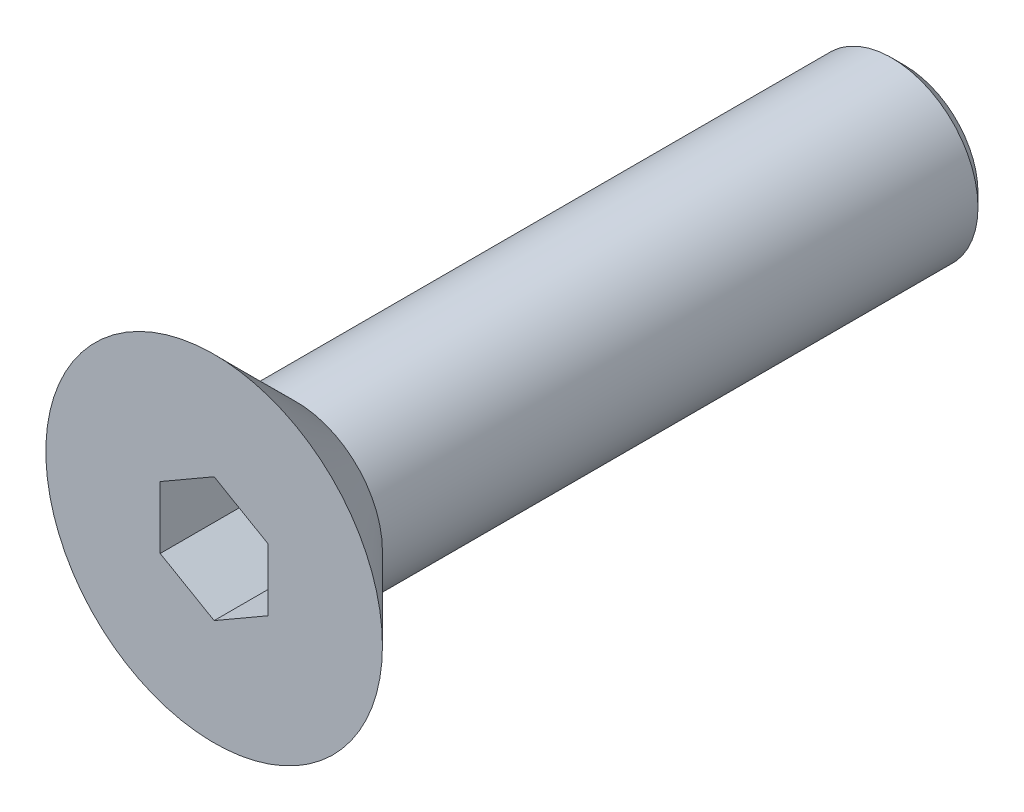
ISO-10303-21;
HEADER;
FILE_DESCRIPTION(('STEP AP214'),'2;1');
FILE_NAME('part.step','',(''),(''),'','','');
FILE_SCHEMA(('AUTOMOTIVE_DESIGN { 1 0 10303 214 1 1 1 1 }'));
ENDSEC;
DATA;
#1=APPLICATION_CONTEXT('core data for automotive mechanical design processes');
#2=APPLICATION_PROTOCOL_DEFINITION('international standard','automotive_design',2000,#1);
#3=PRODUCT_CONTEXT('',#1,'mechanical');
#4=PRODUCT('Part','Part','',(#3));
#5=PRODUCT_RELATED_PRODUCT_CATEGORY('part','',(#4));
#6=PRODUCT_DEFINITION_FORMATION('','',#4);
#7=PRODUCT_DEFINITION_CONTEXT('part definition',#1,'design');
#8=PRODUCT_DEFINITION('design','',#6,#7);
#9=PRODUCT_DEFINITION_SHAPE('','',#8);
#10=(LENGTH_UNIT() NAMED_UNIT(*) SI_UNIT(.MILLI.,.METRE.));
#11=(NAMED_UNIT(*) PLANE_ANGLE_UNIT() SI_UNIT($,.RADIAN.));
#12=(NAMED_UNIT(*) SI_UNIT($,.STERADIAN.) SOLID_ANGLE_UNIT());
#13=UNCERTAINTY_MEASURE_WITH_UNIT(LENGTH_MEASURE(1.E-05),#10,'distance_accuracy_value','');
#14=(GEOMETRIC_REPRESENTATION_CONTEXT(3) GLOBAL_UNCERTAINTY_ASSIGNED_CONTEXT((#13)) GLOBAL_UNIT_ASSIGNED_CONTEXT((#10,
#11,#12)) REPRESENTATION_CONTEXT('',''));
#15=CARTESIAN_POINT('',(0.,0.,0.));
#16=DIRECTION('',(0.,0.,1.));
#17=DIRECTION('',(1.,0.,0.));
#18=AXIS2_PLACEMENT_3D('',#15,#16,#17);
#19=CARTESIAN_POINT('',(0.,0.,2.3));
#20=DIRECTION('',(0.,0.,1.));
#21=DIRECTION('',(1.,0.,0.));
#22=AXIS2_PLACEMENT_3D('',#19,#20,#21);
#23=PLANE('',#22);
#24=CARTESIAN_POINT('',(0.,0.,2.3));
#25=DIRECTION('',(0.,0.,1.));
#26=DIRECTION('',(1.,0.,0.));
#27=AXIS2_PLACEMENT_3D('',#24,#25,#26);
#28=CIRCLE('',#27,3.89999999999996);
#29=CARTESIAN_POINT('',(3.89999999999996,0.,2.3));
#30=VERTEX_POINT('',#29);
#31=EDGE_CURVE('E41',#30,#30,#28,.T.);
#32=ORIENTED_EDGE('',*,*,#31,.T.);
#33=EDGE_LOOP('',(#32));
#34=FACE_BOUND('',#33,.T.);
#35=DIRECTION('',(-0.866025403784439,0.5,0.));
#36=VECTOR('',#35,1.);
#37=CARTESIAN_POINT('',(1.25,0.721687836487033,2.3));
#38=LINE('',#37,#36);
#39=CARTESIAN_POINT('',(1.25,0.721687836487033,2.3));
#40=VERTEX_POINT('',#39);
#41=CARTESIAN_POINT('',(0.,1.44337567297406,2.3));
#42=VERTEX_POINT('',#41);
#43=EDGE_CURVE('E48',#40,#42,#38,.T.);
#44=ORIENTED_EDGE('',*,*,#43,.F.);
#45=DIRECTION('',(0.,1.,0.));
#46=VECTOR('',#45,1.);
#47=CARTESIAN_POINT('',(1.25,-0.721687836487033,2.3));
#48=LINE('',#47,#46);
#49=CARTESIAN_POINT('',(1.25,-0.721687836487033,2.3));
#50=VERTEX_POINT('',#49);
#51=EDGE_CURVE('E131',#50,#40,#48,.T.);
#52=ORIENTED_EDGE('',*,*,#51,.F.);
#53=DIRECTION('',(0.866025403784439,0.5,0.));
#54=VECTOR('',#53,1.);
#55=CARTESIAN_POINT('',(0.,-1.44337567297406,2.3));
#56=LINE('',#55,#54);
#57=CARTESIAN_POINT('',(0.,-1.44337567297406,2.3));
#58=VERTEX_POINT('',#57);
#59=EDGE_CURVE('E129',#58,#50,#56,.T.);
#60=ORIENTED_EDGE('',*,*,#59,.F.);
#61=DIRECTION('',(0.866025403784439,-0.5,0.));
#62=VECTOR('',#61,1.);
#63=CARTESIAN_POINT('',(-1.25,-0.721687836487032,2.3));
#64=LINE('',#63,#62);
#65=CARTESIAN_POINT('',(-1.25,-0.721687836487032,2.3));
#66=VERTEX_POINT('',#65);
#67=EDGE_CURVE('E96',#66,#58,#64,.T.);
#68=ORIENTED_EDGE('',*,*,#67,.F.);
#69=DIRECTION('',(0.,-1.,0.));
#70=VECTOR('',#69,1.);
#71=CARTESIAN_POINT('',(-1.25,0.721687836487033,2.3));
#72=LINE('',#71,#70);
#73=CARTESIAN_POINT('',(-1.25,0.721687836487033,2.3));
#74=VERTEX_POINT('',#73);
#75=EDGE_CURVE('E125',#74,#66,#72,.T.);
#76=ORIENTED_EDGE('',*,*,#75,.F.);
#77=DIRECTION('',(-0.866025403784439,-0.5,0.));
#78=VECTOR('',#77,1.);
#79=CARTESIAN_POINT('',(0.,1.44337567297406,2.3));
#80=LINE('',#79,#78);
#81=EDGE_CURVE('E122',#42,#74,#80,.T.);
#82=ORIENTED_EDGE('',*,*,#81,.F.);
#83=EDGE_LOOP('',(#44,#52,#60,#68,#76,#82));
#84=FACE_BOUND('',#83,.T.);
#85=ADVANCED_FACE('F33',(#34,#84),#23,.T.);
#86=CARTESIAN_POINT('',(0.,0.,-13.7));
#87=DIRECTION('',(0.,0.,1.));
#88=DIRECTION('',(1.,0.,0.));
#89=AXIS2_PLACEMENT_3D('',#86,#87,#88);
#90=CYLINDRICAL_SURFACE('',#89,2.);
#91=CARTESIAN_POINT('',(0.,0.,0.400000000000021));
#92=DIRECTION('',(0.,0.,1.));
#93=DIRECTION('',(1.,0.,0.));
#94=AXIS2_PLACEMENT_3D('',#91,#92,#93);
#95=CIRCLE('',#94,2.);
#96=CARTESIAN_POINT('',(2.,0.,0.400000000000022));
#97=VERTEX_POINT('',#96);
#98=EDGE_CURVE('E11',#97,#97,#95,.F.);
#99=CARTESIAN_POINT('',(0.,0.,-13.4));
#100=DIRECTION('',(0.,0.,-1.));
#101=DIRECTION('',(-1.,0.,0.));
#102=AXIS2_PLACEMENT_3D('',#99,#100,#101);
#103=CIRCLE('',#102,2.);
#104=CARTESIAN_POINT('',(2.,0.,-13.4));
#105=VERTEX_POINT('',#104);
#106=EDGE_CURVE('E143',#105,#105,#103,.F.);
#107=CARTESIAN_POINT('',(2.,0.,0.400000000000022));
#108=CARTESIAN_POINT('',(2.,0.,0.256250000000022));
#109=CARTESIAN_POINT('',(2.,0.,0.112500000000021));
#110=CARTESIAN_POINT('',(2.,0.,-0.17499999999998));
#111=CARTESIAN_POINT('',(2.,0.,-0.31874999999998));
#112=CARTESIAN_POINT('',(2.,0.,-0.606249999999981));
#113=CARTESIAN_POINT('',(2.,0.,-0.749999999999981));
#114=CARTESIAN_POINT('',(2.,0.,-1.03749999999998));
#115=CARTESIAN_POINT('',(2.,0.,-1.18124999999998));
#116=CARTESIAN_POINT('',(2.,0.,-1.46874999999998));
#117=CARTESIAN_POINT('',(2.,0.,-1.61249999999998));
#118=CARTESIAN_POINT('',(2.,0.,-1.89999999999998));
#119=CARTESIAN_POINT('',(2.,0.,-2.04374999999998));
#120=CARTESIAN_POINT('',(2.,0.,-2.33124999999998));
#121=CARTESIAN_POINT('',(2.,0.,-2.47499999999999));
#122=CARTESIAN_POINT('',(2.,0.,-2.76249999999999));
#123=CARTESIAN_POINT('',(2.,0.,-2.90624999999999));
#124=CARTESIAN_POINT('',(2.,0.,-3.19374999999999));
#125=CARTESIAN_POINT('',(2.,0.,-3.33749999999999));
#126=CARTESIAN_POINT('',(2.,0.,-3.62499999999999));
#127=CARTESIAN_POINT('',(2.,0.,-3.76874999999999));
#128=CARTESIAN_POINT('',(2.,0.,-4.05624999999999));
#129=CARTESIAN_POINT('',(2.,0.,-4.19999999999999));
#130=CARTESIAN_POINT('',(2.,0.,-4.48749999999999));
#131=CARTESIAN_POINT('',(2.,0.,-4.63124999999999));
#132=CARTESIAN_POINT('',(2.,0.,-4.91874999999999));
#133=CARTESIAN_POINT('',(2.,0.,-5.06249999999999));
#134=CARTESIAN_POINT('',(2.,0.,-5.34999999999999));
#135=CARTESIAN_POINT('',(2.,0.,-5.49374999999999));
#136=CARTESIAN_POINT('',(2.,0.,-5.78124999999999));
#137=CARTESIAN_POINT('',(2.,0.,-5.92499999999999));
#138=CARTESIAN_POINT('',(2.,0.,-6.21249999999999));
#139=CARTESIAN_POINT('',(2.,0.,-6.35624999999999));
#140=CARTESIAN_POINT('',(2.,0.,-6.64374999999999));
#141=CARTESIAN_POINT('',(2.,0.,-6.78749999999999));
#142=CARTESIAN_POINT('',(2.,0.,-7.07499999999999));
#143=CARTESIAN_POINT('',(2.,0.,-7.21874999999999));
#144=CARTESIAN_POINT('',(2.,0.,-7.50625));
#145=CARTESIAN_POINT('',(2.,0.,-7.65));
#146=CARTESIAN_POINT('',(2.,0.,-7.9375));
#147=CARTESIAN_POINT('',(2.,0.,-8.08125));
#148=CARTESIAN_POINT('',(2.,0.,-8.36875));
#149=CARTESIAN_POINT('',(2.,0.,-8.5125));
#150=CARTESIAN_POINT('',(2.,0.,-8.8));
#151=CARTESIAN_POINT('',(2.,0.,-8.94375));
#152=CARTESIAN_POINT('',(2.,0.,-9.23125));
#153=CARTESIAN_POINT('',(2.,0.,-9.375));
#154=CARTESIAN_POINT('',(2.,0.,-9.6625));
#155=CARTESIAN_POINT('',(2.,0.,-9.80625));
#156=CARTESIAN_POINT('',(2.,0.,-10.09375));
#157=CARTESIAN_POINT('',(2.,0.,-10.2375));
#158=CARTESIAN_POINT('',(2.,0.,-10.525));
#159=CARTESIAN_POINT('',(2.,0.,-10.66875));
#160=CARTESIAN_POINT('',(2.,0.,-10.95625));
#161=CARTESIAN_POINT('',(2.,0.,-11.1));
#162=CARTESIAN_POINT('',(2.,0.,-11.3875));
#163=CARTESIAN_POINT('',(2.,0.,-11.53125));
#164=CARTESIAN_POINT('',(2.,0.,-11.81875));
#165=CARTESIAN_POINT('',(2.,0.,-11.9625));
#166=CARTESIAN_POINT('',(2.,0.,-12.25));
#167=CARTESIAN_POINT('',(2.,0.,-12.39375));
#168=CARTESIAN_POINT('',(2.,0.,-12.68125));
#169=CARTESIAN_POINT('',(2.,0.,-12.825));
#170=CARTESIAN_POINT('',(2.,0.,-13.1125));
#171=CARTESIAN_POINT('',(2.,0.,-13.25625));
#172=CARTESIAN_POINT('',(2.,0.,-13.4));
#173=B_SPLINE_CURVE_WITH_KNOTS('',3,(#107,#108,#109,#110,#111,#112,#113,#114,#115,#116,#117,
#118,#119,#120,#121,#122,#123,#124,#125,#126,#127,#128,#129,#130,#131,#132,#133,#134,#135,#136,
#137,#138,#139,#140,#141,#142,#143,#144,#145,#146,#147,#148,#149,#150,#151,#152,#153,#154,#155,
#156,#157,#158,#159,#160,#161,#162,#163,#164,#165,#166,#167,#168,#169,#170,#171,#172),
.UNSPECIFIED.,.F.,.F.,(4,2,2,2,2,2,2,2,2,2,2,2,2,2,2,2,2,2,2,2,2,2,2,2,2,2,2,2,2,2,2,2,4),(0.,
0.431250000000001,0.862500000000002,1.29375,1.725,2.15625000000001,2.58750000000001,
3.01875000000001,3.45000000000001,3.88125000000001,4.31250000000001,4.74375000000001,
5.17500000000001,5.60625000000001,6.03750000000001,6.46875000000001,6.90000000000001,
7.33125000000002,7.76250000000002,8.19375000000002,8.62500000000002,9.05625000000002,
9.48750000000002,9.91875000000002,10.35,10.78125,11.2125,11.64375,12.075,12.50625,12.9375,
13.36875,13.8),.UNSPECIFIED.);
#174=EDGE_CURVE('BSEAM159',#97,#105,#173,.T.);
#175=ORIENTED_EDGE('',*,*,#98,.T.);
#176=ORIENTED_EDGE('',*,*,#106,.T.);
#177=ORIENTED_EDGE('',*,*,#174,.T.);
#178=ORIENTED_EDGE('',*,*,#174,.F.);
#179=EDGE_LOOP('',(#175,#177,#176,#178));
#180=FACE_BOUND('',#179,.T.);
#181=ADVANCED_FACE('F159',(#180),#90,.T.);
#182=CARTESIAN_POINT('',(0.,0.,-13.7));
#183=DIRECTION('',(0.,0.,-1.));
#184=DIRECTION('',(-1.,0.,0.));
#185=AXIS2_PLACEMENT_3D('',#182,#183,#184);
#186=PLANE('',#185);
#187=CARTESIAN_POINT('',(0.,0.,-13.7));
#188=DIRECTION('',(0.,0.,-1.));
#189=DIRECTION('',(-1.,0.,0.));
#190=AXIS2_PLACEMENT_3D('',#187,#188,#189);
#191=CIRCLE('',#190,1.70000000000001);
#192=CARTESIAN_POINT('',(-1.70000000000001,0.,-13.7));
#193=VERTEX_POINT('',#192);
#194=EDGE_CURVE('E135',#193,#193,#191,.T.);
#195=ORIENTED_EDGE('',*,*,#194,.T.);
#196=EDGE_LOOP('',(#195));
#197=FACE_BOUND('',#196,.T.);
#198=ADVANCED_FACE('F164',(#197),#186,.T.);
#199=CARTESIAN_POINT('',(0.,0.,-13.7));
#200=DIRECTION('',(0.,0.,1.));
#201=DIRECTION('',(1.,0.,0.));
#202=AXIS2_PLACEMENT_3D('',#199,#200,#201);
#203=CONICAL_SURFACE('',#202,1.70000000000001,0.785398163397446);
#204=ORIENTED_EDGE('',*,*,#106,.F.);
#205=EDGE_LOOP('',(#204));
#206=FACE_BOUND('',#205,.T.);
#207=ORIENTED_EDGE('',*,*,#194,.F.);
#208=EDGE_LOOP('',(#207));
#209=FACE_BOUND('',#208,.T.);
#210=ADVANCED_FACE('F168',(#206,#209),#203,.T.);
#211=CARTESIAN_POINT('',(1.25,0.721687836487033,0.3));
#212=DIRECTION('',(0.5,0.866025403784439,0.));
#213=DIRECTION('',(-0.866025403784439,0.5,0.));
#214=AXIS2_PLACEMENT_3D('',#211,#212,#213);
#215=PLANE('',#214);
#216=ORIENTED_EDGE('',*,*,#43,.T.);
#217=DIRECTION('',(0.,0.,1.));
#218=VECTOR('',#217,1.);
#219=CARTESIAN_POINT('',(0.,1.44337567297406,0.3));
#220=LINE('',#219,#218);
#221=CARTESIAN_POINT('',(0.,1.44337567297406,0.3));
#222=VERTEX_POINT('',#221);
#223=EDGE_CURVE('E78',#222,#42,#220,.T.);
#224=ORIENTED_EDGE('',*,*,#223,.F.);
#225=DIRECTION('',(-0.866025403784439,0.5,0.));
#226=VECTOR('',#225,1.);
#227=CARTESIAN_POINT('',(1.25,0.721687836487033,0.3));
#228=LINE('',#227,#226);
#229=CARTESIAN_POINT('',(1.25,0.721687836487033,0.3));
#230=VERTEX_POINT('',#229);
#231=EDGE_CURVE('E133',#230,#222,#228,.T.);
#232=ORIENTED_EDGE('',*,*,#231,.F.);
#233=DIRECTION('',(0.,0.,1.));
#234=VECTOR('',#233,1.);
#235=CARTESIAN_POINT('',(1.25,0.721687836487033,0.3));
#236=LINE('',#235,#234);
#237=EDGE_CURVE('E56',#230,#40,#236,.T.);
#238=ORIENTED_EDGE('',*,*,#237,.T.);
#239=EDGE_LOOP('',(#216,#224,#232,#238));
#240=FACE_BOUND('',#239,.T.);
#241=ADVANCED_FACE('F170',(#240),#215,.F.);
#242=CARTESIAN_POINT('',(1.25,-0.721687836487033,0.3));
#243=DIRECTION('',(1.,0.,0.));
#244=DIRECTION('',(0.,1.,0.));
#245=AXIS2_PLACEMENT_3D('',#242,#243,#244);
#246=PLANE('',#245);
#247=ORIENTED_EDGE('',*,*,#51,.T.);
#248=ORIENTED_EDGE('',*,*,#237,.F.);
#249=DIRECTION('',(0.,1.,0.));
#250=VECTOR('',#249,1.);
#251=CARTESIAN_POINT('',(1.25,-0.721687836487033,0.3));
#252=LINE('',#251,#250);
#253=CARTESIAN_POINT('',(1.25,-0.721687836487033,0.3));
#254=VERTEX_POINT('',#253);
#255=EDGE_CURVE('E108',#254,#230,#252,.T.);
#256=ORIENTED_EDGE('',*,*,#255,.F.);
#257=DIRECTION('',(0.,0.,1.));
#258=VECTOR('',#257,1.);
#259=CARTESIAN_POINT('',(1.25,-0.721687836487033,0.3));
#260=LINE('',#259,#258);
#261=EDGE_CURVE('E100',#254,#50,#260,.T.);
#262=ORIENTED_EDGE('',*,*,#261,.T.);
#263=EDGE_LOOP('',(#247,#248,#256,#262));
#264=FACE_BOUND('',#263,.T.);
#265=ADVANCED_FACE('F176',(#264),#246,.F.);
#266=CARTESIAN_POINT('',(0.,-1.44337567297406,0.3));
#267=DIRECTION('',(0.5,-0.866025403784439,0.));
#268=DIRECTION('',(0.866025403784439,0.5,0.));
#269=AXIS2_PLACEMENT_3D('',#266,#267,#268);
#270=PLANE('',#269);
#271=ORIENTED_EDGE('',*,*,#59,.T.);
#272=ORIENTED_EDGE('',*,*,#261,.F.);
#273=DIRECTION('',(0.866025403784439,0.5,0.));
#274=VECTOR('',#273,1.);
#275=CARTESIAN_POINT('',(0.,-1.44337567297406,0.3));
#276=LINE('',#275,#274);
#277=CARTESIAN_POINT('',(0.,-1.44337567297406,0.3));
#278=VERTEX_POINT('',#277);
#279=EDGE_CURVE('E104',#278,#254,#276,.T.);
#280=ORIENTED_EDGE('',*,*,#279,.F.);
#281=DIRECTION('',(0.,0.,1.));
#282=VECTOR('',#281,1.);
#283=CARTESIAN_POINT('',(0.,-1.44337567297406,0.3));
#284=LINE('',#283,#282);
#285=EDGE_CURVE('E89',#278,#58,#284,.T.);
#286=ORIENTED_EDGE('',*,*,#285,.T.);
#287=EDGE_LOOP('',(#271,#272,#280,#286));
#288=FACE_BOUND('',#287,.T.);
#289=ADVANCED_FACE('F105',(#288),#270,.F.);
#290=CARTESIAN_POINT('',(-1.25,-0.721687836487032,0.3));
#291=DIRECTION('',(-0.5,-0.866025403784439,0.));
#292=DIRECTION('',(0.866025403784439,-0.5,0.));
#293=AXIS2_PLACEMENT_3D('',#290,#291,#292);
#294=PLANE('',#293);
#295=ORIENTED_EDGE('',*,*,#67,.T.);
#296=ORIENTED_EDGE('',*,*,#285,.F.);
#297=DIRECTION('',(0.866025403784439,-0.5,0.));
#298=VECTOR('',#297,1.);
#299=CARTESIAN_POINT('',(-1.25,-0.721687836487032,0.3));
#300=LINE('',#299,#298);
#301=CARTESIAN_POINT('',(-1.25,-0.721687836487032,0.3));
#302=VERTEX_POINT('',#301);
#303=EDGE_CURVE('E93',#302,#278,#300,.T.);
#304=ORIENTED_EDGE('',*,*,#303,.F.);
#305=DIRECTION('',(0.,0.,1.));
#306=VECTOR('',#305,1.);
#307=CARTESIAN_POINT('',(-1.25,-0.721687836487032,0.3));
#308=LINE('',#307,#306);
#309=EDGE_CURVE('E101',#302,#66,#308,.T.);
#310=ORIENTED_EDGE('',*,*,#309,.T.);
#311=EDGE_LOOP('',(#295,#296,#304,#310));
#312=FACE_BOUND('',#311,.T.);
#313=ADVANCED_FACE('F91',(#312),#294,.F.);
#314=CARTESIAN_POINT('',(-1.25,0.721687836487033,0.3));
#315=DIRECTION('',(-1.,0.,0.));
#316=DIRECTION('',(0.,0.,1.));
#317=AXIS2_PLACEMENT_3D('',#314,#315,#316);
#318=PLANE('',#317);
#319=ORIENTED_EDGE('',*,*,#75,.T.);
#320=ORIENTED_EDGE('',*,*,#309,.F.);
#321=DIRECTION('',(0.,-1.,0.));
#322=VECTOR('',#321,1.);
#323=CARTESIAN_POINT('',(-1.25,0.721687836487033,0.3));
#324=LINE('',#323,#322);
#325=CARTESIAN_POINT('',(-1.25,0.721687836487033,0.3));
#326=VERTEX_POINT('',#325);
#327=EDGE_CURVE('E114',#326,#302,#324,.T.);
#328=ORIENTED_EDGE('',*,*,#327,.F.);
#329=DIRECTION('',(0.,0.,1.));
#330=VECTOR('',#329,1.);
#331=CARTESIAN_POINT('',(-1.25,0.721687836487033,0.3));
#332=LINE('',#331,#330);
#333=EDGE_CURVE('E138',#326,#74,#332,.T.);
#334=ORIENTED_EDGE('',*,*,#333,.T.);
#335=EDGE_LOOP('',(#319,#320,#328,#334));
#336=FACE_BOUND('',#335,.T.);
#337=ADVANCED_FACE('F188',(#336),#318,.F.);
#338=CARTESIAN_POINT('',(0.,1.44337567297406,0.3));
#339=DIRECTION('',(-0.5,0.866025403784439,0.));
#340=DIRECTION('',(-0.866025403784439,-0.5,0.));
#341=AXIS2_PLACEMENT_3D('',#338,#339,#340);
#342=PLANE('',#341);
#343=ORIENTED_EDGE('',*,*,#81,.T.);
#344=ORIENTED_EDGE('',*,*,#333,.F.);
#345=DIRECTION('',(-0.866025403784439,-0.5,0.));
#346=VECTOR('',#345,1.);
#347=CARTESIAN_POINT('',(0.,1.44337567297406,0.3));
#348=LINE('',#347,#346);
#349=EDGE_CURVE('E116',#222,#326,#348,.T.);
#350=ORIENTED_EDGE('',*,*,#349,.F.);
#351=ORIENTED_EDGE('',*,*,#223,.T.);
#352=EDGE_LOOP('',(#343,#344,#350,#351));
#353=FACE_BOUND('',#352,.T.);
#354=ADVANCED_FACE('F155',(#353),#342,.F.);
#355=CARTESIAN_POINT('',(0.,0.,0.3));
#356=DIRECTION('',(0.,0.,1.));
#357=DIRECTION('',(1.,0.,0.));
#358=AXIS2_PLACEMENT_3D('',#355,#356,#357);
#359=PLANE('',#358);
#360=ORIENTED_EDGE('',*,*,#231,.T.);
#361=ORIENTED_EDGE('',*,*,#349,.T.);
#362=ORIENTED_EDGE('',*,*,#327,.T.);
#363=ORIENTED_EDGE('',*,*,#303,.T.);
#364=ORIENTED_EDGE('',*,*,#279,.T.);
#365=ORIENTED_EDGE('',*,*,#255,.T.);
#366=EDGE_LOOP('',(#360,#361,#362,#363,#364,#365));
#367=FACE_BOUND('',#366,.T.);
#368=ADVANCED_FACE('F111',(#367),#359,.T.);
#369=CARTESIAN_POINT('',(0.,0.,2.40000000000004));
#370=DIRECTION('',(0.,0.,1.));
#371=DIRECTION('',(1.,0.,0.));
#372=AXIS2_PLACEMENT_3D('',#369,#370,#371);
#373=CONICAL_SURFACE('',#372,4.,0.785398163397443);
#374=ORIENTED_EDGE('',*,*,#98,.F.);
#375=EDGE_LOOP('',(#374));
#376=FACE_BOUND('',#375,.T.);
#377=ORIENTED_EDGE('',*,*,#31,.F.);
#378=EDGE_LOOP('',(#377));
#379=FACE_BOUND('',#378,.T.);
#380=ADVANCED_FACE('F35',(#376,#379),#373,.T.);
#381=CLOSED_SHELL('',(#85,#181,#198,#210,#241,#265,#289,#313,#337,#354,#368,#380));
#382=MANIFOLD_SOLID_BREP('B2',#381);
#383=ADVANCED_BREP_SHAPE_REPRESENTATION('',(#18,#382),#14);
#384=SHAPE_DEFINITION_REPRESENTATION(#9,#383);
ENDSEC;
END-ISO-10303-21;
